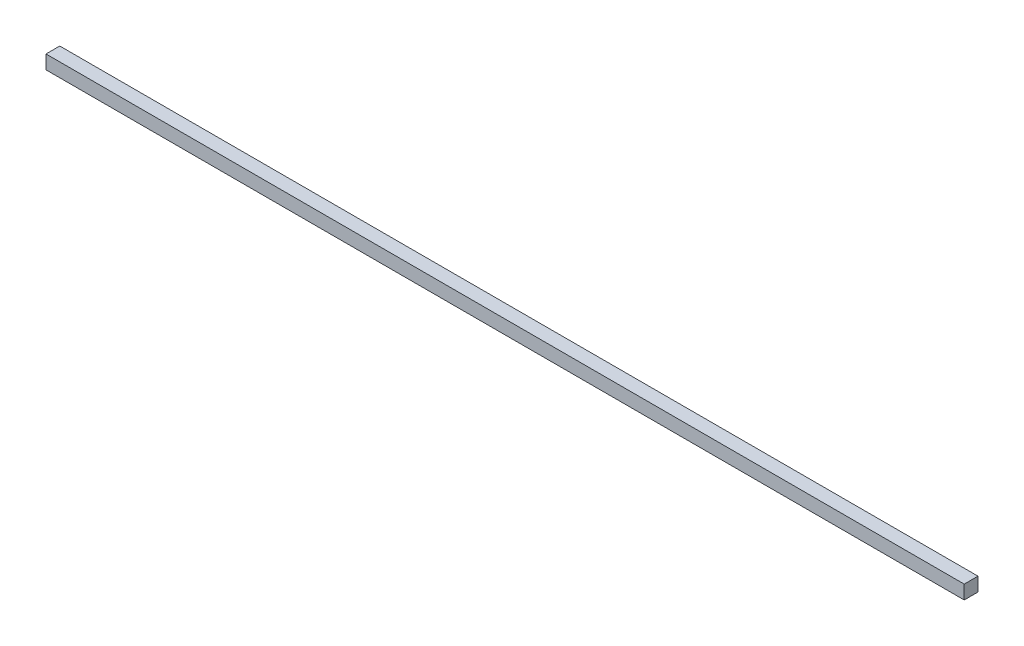
ISO-10303-21;
HEADER;
FILE_DESCRIPTION(('STEP AP214'),'2;1');
FILE_NAME('part.step','',(''),(''),'','','');
FILE_SCHEMA(('AUTOMOTIVE_DESIGN { 1 0 10303 214 1 1 1 1 }'));
ENDSEC;
DATA;
#1=APPLICATION_CONTEXT('core data for automotive mechanical design processes');
#2=APPLICATION_PROTOCOL_DEFINITION('international standard','automotive_design',2000,#1);
#3=PRODUCT_CONTEXT('',#1,'mechanical');
#4=PRODUCT('Part','Part','',(#3));
#5=PRODUCT_RELATED_PRODUCT_CATEGORY('part','',(#4));
#6=PRODUCT_DEFINITION_FORMATION('','',#4);
#7=PRODUCT_DEFINITION_CONTEXT('part definition',#1,'design');
#8=PRODUCT_DEFINITION('design','',#6,#7);
#9=PRODUCT_DEFINITION_SHAPE('','',#8);
#10=(LENGTH_UNIT() NAMED_UNIT(*) SI_UNIT(.MILLI.,.METRE.));
#11=(NAMED_UNIT(*) PLANE_ANGLE_UNIT() SI_UNIT($,.RADIAN.));
#12=(NAMED_UNIT(*) SI_UNIT($,.STERADIAN.) SOLID_ANGLE_UNIT());
#13=UNCERTAINTY_MEASURE_WITH_UNIT(LENGTH_MEASURE(1.E-05),#10,'distance_accuracy_value','');
#14=(GEOMETRIC_REPRESENTATION_CONTEXT(3) GLOBAL_UNCERTAINTY_ASSIGNED_CONTEXT((#13)) GLOBAL_UNIT_ASSIGNED_CONTEXT((#10,
#11,#12)) REPRESENTATION_CONTEXT('',''));
#15=CARTESIAN_POINT('',(0.,0.,0.));
#16=DIRECTION('',(0.,0.,1.));
#17=DIRECTION('',(1.,0.,0.));
#18=AXIS2_PLACEMENT_3D('',#15,#16,#17);
#19=CARTESIAN_POINT('',(-113.813370473538,-33.4902506963789,3.));
#20=DIRECTION('',(0.,-1.,0.));
#21=DIRECTION('',(1.,0.,0.));
#22=AXIS2_PLACEMENT_3D('',#19,#20,#21);
#23=PLANE('',#22);
#24=DIRECTION('',(-1.,0.,0.));
#25=VECTOR('',#24,1.);
#26=CARTESIAN_POINT('',(-113.813370473538,-33.4902506963789,0.));
#27=LINE('',#26,#25);
#28=CARTESIAN_POINT('',(86.1866295264623,-33.4902506963788,0.));
#29=VERTEX_POINT('',#28);
#30=CARTESIAN_POINT('',(-113.813370473538,-33.4902506963789,0.));
#31=VERTEX_POINT('',#30);
#32=EDGE_CURVE('E96',#29,#31,#27,.T.);
#33=ORIENTED_EDGE('',*,*,#32,.T.);
#34=DIRECTION('',(0.,0.,-1.));
#35=VECTOR('',#34,1.);
#36=CARTESIAN_POINT('',(-113.813370473538,-33.4902506963789,3.));
#37=LINE('',#36,#35);
#38=CARTESIAN_POINT('',(-113.813370473538,-33.4902506963789,3.));
#39=VERTEX_POINT('',#38);
#40=EDGE_CURVE('E11',#39,#31,#37,.T.);
#41=ORIENTED_EDGE('',*,*,#40,.F.);
#42=DIRECTION('',(-1.,0.,0.));
#43=VECTOR('',#42,1.);
#44=CARTESIAN_POINT('',(-113.813370473538,-33.4902506963789,3.));
#45=LINE('',#44,#43);
#46=CARTESIAN_POINT('',(86.1866295264623,-33.4902506963788,3.));
#47=VERTEX_POINT('',#46);
#48=EDGE_CURVE('E84',#47,#39,#45,.T.);
#49=ORIENTED_EDGE('',*,*,#48,.F.);
#50=DIRECTION('',(0.,0.,-1.));
#51=VECTOR('',#50,1.);
#52=CARTESIAN_POINT('',(86.1866295264623,-33.4902506963788,3.));
#53=LINE('',#52,#51);
#54=EDGE_CURVE('E92',#47,#29,#53,.T.);
#55=ORIENTED_EDGE('',*,*,#54,.T.);
#56=EDGE_LOOP('',(#33,#41,#49,#55));
#57=FACE_BOUND('',#56,.T.);
#58=ADVANCED_FACE('F33',(#57),#23,.F.);
#59=CARTESIAN_POINT('',(-113.813370473538,-33.4902506963789,3.));
#60=DIRECTION('',(1.,0.,0.));
#61=DIRECTION('',(0.,1.,0.));
#62=AXIS2_PLACEMENT_3D('',#59,#60,#61);
#63=PLANE('',#62);
#64=DIRECTION('',(0.,-1.,0.));
#65=VECTOR('',#64,1.);
#66=CARTESIAN_POINT('',(-113.813370473538,-33.4902506963789,0.));
#67=LINE('',#66,#65);
#68=CARTESIAN_POINT('',(-113.813370473538,-36.4902506963789,0.));
#69=VERTEX_POINT('',#68);
#70=EDGE_CURVE('E88',#31,#69,#67,.T.);
#71=ORIENTED_EDGE('',*,*,#70,.T.);
#72=DIRECTION('',(0.,0.,-1.));
#73=VECTOR('',#72,1.);
#74=CARTESIAN_POINT('',(-113.813370473538,-36.4902506963789,3.));
#75=LINE('',#74,#73);
#76=CARTESIAN_POINT('',(-113.813370473538,-36.4902506963789,3.));
#77=VERTEX_POINT('',#76);
#78=EDGE_CURVE('E41',#77,#69,#75,.T.);
#79=ORIENTED_EDGE('',*,*,#78,.F.);
#80=DIRECTION('',(0.,-1.,0.));
#81=VECTOR('',#80,1.);
#82=CARTESIAN_POINT('',(-113.813370473538,-33.4902506963789,3.));
#83=LINE('',#82,#81);
#84=EDGE_CURVE('E79',#39,#77,#83,.T.);
#85=ORIENTED_EDGE('',*,*,#84,.F.);
#86=ORIENTED_EDGE('',*,*,#40,.T.);
#87=EDGE_LOOP('',(#71,#79,#85,#86));
#88=FACE_BOUND('',#87,.T.);
#89=ADVANCED_FACE('F87',(#88),#63,.F.);
#90=CARTESIAN_POINT('',(-113.813370473538,-36.4902506963789,3.));
#91=DIRECTION('',(0.,1.,0.));
#92=DIRECTION('',(0.,0.,1.));
#93=AXIS2_PLACEMENT_3D('',#90,#91,#92);
#94=PLANE('',#93);
#95=DIRECTION('',(1.,0.,0.));
#96=VECTOR('',#95,1.);
#97=CARTESIAN_POINT('',(-113.813370473538,-36.4902506963789,0.));
#98=LINE('',#97,#96);
#99=CARTESIAN_POINT('',(86.1866295264623,-36.4902506963789,0.));
#100=VERTEX_POINT('',#99);
#101=EDGE_CURVE('E66',#69,#100,#98,.T.);
#102=ORIENTED_EDGE('',*,*,#101,.T.);
#103=DIRECTION('',(0.,0.,-1.));
#104=VECTOR('',#103,1.);
#105=CARTESIAN_POINT('',(86.1866295264623,-36.4902506963789,3.));
#106=LINE('',#105,#104);
#107=CARTESIAN_POINT('',(86.1866295264623,-36.4902506963789,3.));
#108=VERTEX_POINT('',#107);
#109=EDGE_CURVE('E89',#108,#100,#106,.T.);
#110=ORIENTED_EDGE('',*,*,#109,.F.);
#111=DIRECTION('',(1.,0.,0.));
#112=VECTOR('',#111,1.);
#113=CARTESIAN_POINT('',(-113.813370473538,-36.4902506963789,3.));
#114=LINE('',#113,#112);
#115=EDGE_CURVE('E82',#77,#108,#114,.T.);
#116=ORIENTED_EDGE('',*,*,#115,.F.);
#117=ORIENTED_EDGE('',*,*,#78,.T.);
#118=EDGE_LOOP('',(#102,#110,#116,#117));
#119=FACE_BOUND('',#118,.T.);
#120=ADVANCED_FACE('F90',(#119),#94,.F.);
#121=CARTESIAN_POINT('',(86.1866295264623,-33.4902506963788,3.));
#122=DIRECTION('',(-1.,0.,0.));
#123=DIRECTION('',(0.,-1.,0.));
#124=AXIS2_PLACEMENT_3D('',#121,#122,#123);
#125=PLANE('',#124);
#126=DIRECTION('',(0.,1.,0.));
#127=VECTOR('',#126,1.);
#128=CARTESIAN_POINT('',(86.1866295264623,-33.4902506963788,0.));
#129=LINE('',#128,#127);
#130=EDGE_CURVE('E72',#100,#29,#129,.T.);
#131=ORIENTED_EDGE('',*,*,#130,.T.);
#132=ORIENTED_EDGE('',*,*,#54,.F.);
#133=DIRECTION('',(0.,1.,0.));
#134=VECTOR('',#133,1.);
#135=CARTESIAN_POINT('',(86.1866295264623,-33.4902506963788,3.));
#136=LINE('',#135,#134);
#137=EDGE_CURVE('E49',#108,#47,#136,.T.);
#138=ORIENTED_EDGE('',*,*,#137,.F.);
#139=ORIENTED_EDGE('',*,*,#109,.T.);
#140=EDGE_LOOP('',(#131,#132,#138,#139));
#141=FACE_BOUND('',#140,.T.);
#142=ADVANCED_FACE('F103',(#141),#125,.F.);
#143=CARTESIAN_POINT('',(0.,0.,3.));
#144=DIRECTION('',(0.,0.,-1.));
#145=DIRECTION('',(-1.,0.,0.));
#146=AXIS2_PLACEMENT_3D('',#143,#144,#145);
#147=PLANE('',#146);
#148=ORIENTED_EDGE('',*,*,#48,.T.);
#149=ORIENTED_EDGE('',*,*,#84,.T.);
#150=ORIENTED_EDGE('',*,*,#115,.T.);
#151=ORIENTED_EDGE('',*,*,#137,.T.);
#152=EDGE_LOOP('',(#148,#149,#150,#151));
#153=FACE_BOUND('',#152,.T.);
#154=ADVANCED_FACE('F80',(#153),#147,.F.);
#155=CARTESIAN_POINT('',(0.,0.,0.));
#156=DIRECTION('',(0.,0.,-1.));
#157=DIRECTION('',(-1.,0.,0.));
#158=AXIS2_PLACEMENT_3D('',#155,#156,#157);
#159=PLANE('',#158);
#160=ORIENTED_EDGE('',*,*,#32,.F.);
#161=ORIENTED_EDGE('',*,*,#130,.F.);
#162=ORIENTED_EDGE('',*,*,#101,.F.);
#163=ORIENTED_EDGE('',*,*,#70,.F.);
#164=EDGE_LOOP('',(#160,#161,#162,#163));
#165=FACE_BOUND('',#164,.T.);
#166=ADVANCED_FACE('F106',(#165),#159,.T.);
#167=CLOSED_SHELL('',(#58,#89,#120,#142,#154,#166));
#168=MANIFOLD_SOLID_BREP('B2',#167);
#169=ADVANCED_BREP_SHAPE_REPRESENTATION('',(#18,#168),#14);
#170=SHAPE_DEFINITION_REPRESENTATION(#9,#169);
ENDSEC;
END-ISO-10303-21;
